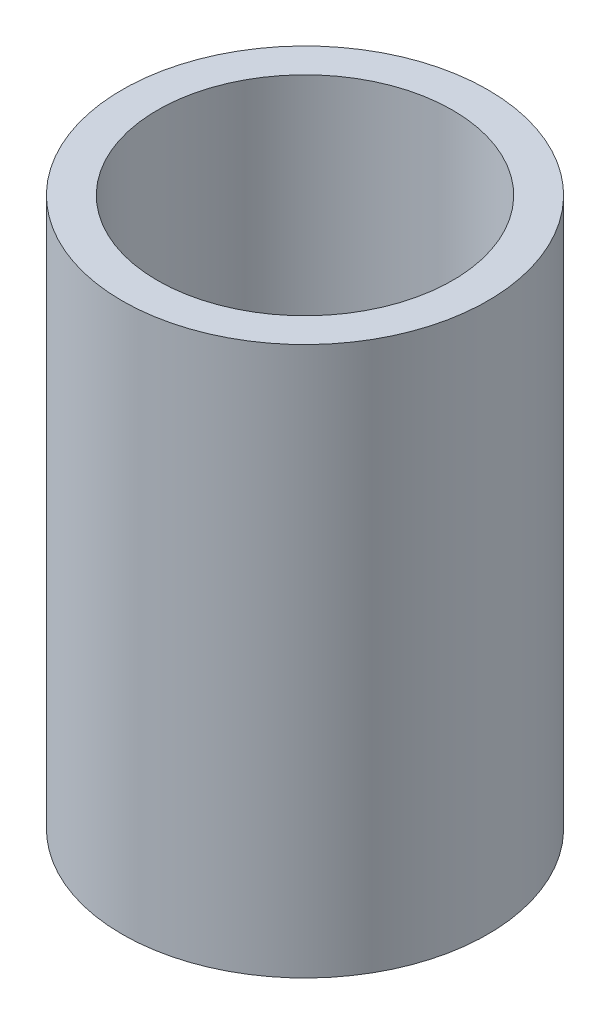
ISO-10303-21;
HEADER;
FILE_DESCRIPTION(('STEP AP214'),'2;1');
FILE_NAME('part.step','',(''),(''),'','','');
FILE_SCHEMA(('AUTOMOTIVE_DESIGN { 1 0 10303 214 1 1 1 1 }'));
ENDSEC;
DATA;
#1=APPLICATION_CONTEXT('core data for automotive mechanical design processes');
#2=APPLICATION_PROTOCOL_DEFINITION('international standard','automotive_design',2000,#1);
#3=PRODUCT_CONTEXT('',#1,'mechanical');
#4=PRODUCT('Part','Part','',(#3));
#5=PRODUCT_RELATED_PRODUCT_CATEGORY('part','',(#4));
#6=PRODUCT_DEFINITION_FORMATION('','',#4);
#7=PRODUCT_DEFINITION_CONTEXT('part definition',#1,'design');
#8=PRODUCT_DEFINITION('design','',#6,#7);
#9=PRODUCT_DEFINITION_SHAPE('','',#8);
#10=(LENGTH_UNIT() NAMED_UNIT(*) SI_UNIT(.MILLI.,.METRE.));
#11=(NAMED_UNIT(*) PLANE_ANGLE_UNIT() SI_UNIT($,.RADIAN.));
#12=(NAMED_UNIT(*) SI_UNIT($,.STERADIAN.) SOLID_ANGLE_UNIT());
#13=UNCERTAINTY_MEASURE_WITH_UNIT(LENGTH_MEASURE(1.E-05),#10,'distance_accuracy_value','');
#14=(GEOMETRIC_REPRESENTATION_CONTEXT(3) GLOBAL_UNCERTAINTY_ASSIGNED_CONTEXT((#13)) GLOBAL_UNIT_ASSIGNED_CONTEXT((#10,
#11,#12)) REPRESENTATION_CONTEXT('',''));
#15=CARTESIAN_POINT('',(0.,0.,0.));
#16=DIRECTION('',(0.,0.,1.));
#17=DIRECTION('',(1.,0.,0.));
#18=AXIS2_PLACEMENT_3D('',#15,#16,#17);
#19=CARTESIAN_POINT('',(20.5,0.,0.));
#20=DIRECTION('',(0.,1.,0.));
#21=DIRECTION('',(0.,0.,1.));
#22=AXIS2_PLACEMENT_3D('',#19,#20,#21);
#23=PLANE('',#22);
#24=CARTESIAN_POINT('',(0.,0.,0.));
#25=DIRECTION('',(0.,1.,0.));
#26=DIRECTION('',(0.,0.,1.));
#27=AXIS2_PLACEMENT_3D('',#24,#25,#26);
#28=CIRCLE('',#27,25.4);
#29=CARTESIAN_POINT('',(0.,0.,25.4));
#30=VERTEX_POINT('',#29);
#31=EDGE_CURVE('E10',#30,#30,#28,.T.);
#32=ORIENTED_EDGE('',*,*,#31,.F.);
#33=EDGE_LOOP('',(#32));
#34=FACE_BOUND('',#33,.T.);
#35=CARTESIAN_POINT('',(0.,0.,0.));
#36=DIRECTION('',(0.,1.,0.));
#37=DIRECTION('',(0.,0.,1.));
#38=AXIS2_PLACEMENT_3D('',#35,#36,#37);
#39=CIRCLE('',#38,20.5);
#40=CARTESIAN_POINT('',(0.,0.,20.5));
#41=VERTEX_POINT('',#40);
#42=EDGE_CURVE('E51',#41,#41,#39,.T.);
#43=ORIENTED_EDGE('',*,*,#42,.T.);
#44=EDGE_LOOP('',(#43));
#45=FACE_BOUND('',#44,.T.);
#46=ADVANCED_FACE('F37',(#34,#45),#23,.F.);
#47=CARTESIAN_POINT('',(0.,161.376166943427,0.));
#48=DIRECTION('',(0.,1.,0.));
#49=DIRECTION('',(0.,0.,1.));
#50=AXIS2_PLACEMENT_3D('',#47,#48,#49);
#51=CYLINDRICAL_SURFACE('',#50,25.4);
#52=CARTESIAN_POINT('',(0.,76.2,0.));
#53=DIRECTION('',(0.,1.,0.));
#54=DIRECTION('',(0.,0.,1.));
#55=AXIS2_PLACEMENT_3D('',#52,#53,#54);
#56=CIRCLE('',#55,25.4);
#57=CARTESIAN_POINT('',(0.,76.2,25.4));
#58=VERTEX_POINT('',#57);
#59=EDGE_CURVE('E43',#58,#58,#56,.T.);
#60=ORIENTED_EDGE('',*,*,#59,.F.);
#61=EDGE_LOOP('',(#60));
#62=FACE_BOUND('',#61,.T.);
#63=ORIENTED_EDGE('',*,*,#31,.T.);
#64=EDGE_LOOP('',(#63));
#65=FACE_BOUND('',#64,.T.);
#66=ADVANCED_FACE('F66',(#62,#65),#51,.T.);
#67=CARTESIAN_POINT('',(20.5,76.2,0.));
#68=DIRECTION('',(0.,-1.,0.));
#69=DIRECTION('',(0.,0.,-1.));
#70=AXIS2_PLACEMENT_3D('',#67,#68,#69);
#71=PLANE('',#70);
#72=CARTESIAN_POINT('',(0.,76.2,0.));
#73=DIRECTION('',(0.,1.,0.));
#74=DIRECTION('',(0.,0.,1.));
#75=AXIS2_PLACEMENT_3D('',#72,#73,#74);
#76=CIRCLE('',#75,20.5);
#77=CARTESIAN_POINT('',(0.,76.2,20.5));
#78=VERTEX_POINT('',#77);
#79=EDGE_CURVE('E47',#78,#78,#76,.T.);
#80=ORIENTED_EDGE('',*,*,#79,.F.);
#81=EDGE_LOOP('',(#80));
#82=FACE_BOUND('',#81,.T.);
#83=ORIENTED_EDGE('',*,*,#59,.T.);
#84=EDGE_LOOP('',(#83));
#85=FACE_BOUND('',#84,.T.);
#86=ADVANCED_FACE('F61',(#82,#85),#71,.F.);
#87=CARTESIAN_POINT('',(0.,161.376166943427,0.));
#88=DIRECTION('',(0.,1.,0.));
#89=DIRECTION('',(0.,0.,1.));
#90=AXIS2_PLACEMENT_3D('',#87,#88,#89);
#91=CYLINDRICAL_SURFACE('',#90,20.5);
#92=ORIENTED_EDGE('',*,*,#42,.F.);
#93=EDGE_LOOP('',(#92));
#94=FACE_BOUND('',#93,.T.);
#95=ORIENTED_EDGE('',*,*,#79,.T.);
#96=EDGE_LOOP('',(#95));
#97=FACE_BOUND('',#96,.T.);
#98=ADVANCED_FACE('F58',(#94,#97),#91,.F.);
#99=CLOSED_SHELL('',(#46,#66,#86,#98));
#100=MANIFOLD_SOLID_BREP('B2',#99);
#101=ADVANCED_BREP_SHAPE_REPRESENTATION('',(#18,#100),#14);
#102=SHAPE_DEFINITION_REPRESENTATION(#9,#101);
ENDSEC;
END-ISO-10303-21;
